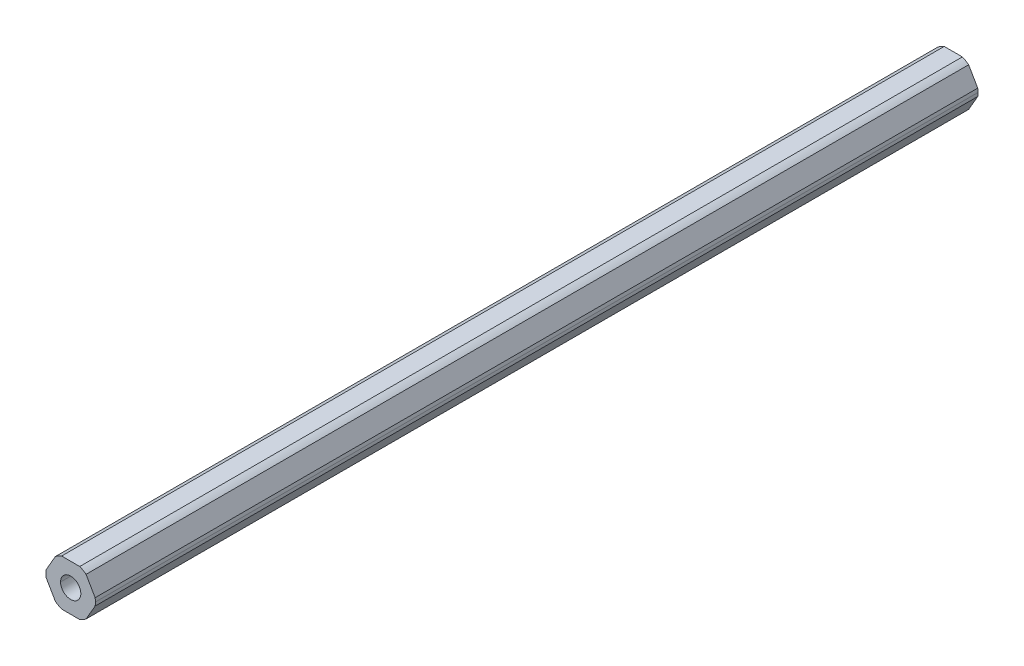
ISO-10303-21;
HEADER;
FILE_DESCRIPTION(('STEP AP214'),'2;1');
FILE_NAME('part.step','',(''),(''),'','','');
FILE_SCHEMA(('AUTOMOTIVE_DESIGN { 1 0 10303 214 1 1 1 1 }'));
ENDSEC;
DATA;
#1=APPLICATION_CONTEXT('core data for automotive mechanical design processes');
#2=APPLICATION_PROTOCOL_DEFINITION('international standard','automotive_design',2000,#1);
#3=PRODUCT_CONTEXT('',#1,'mechanical');
#4=PRODUCT('Part','Part','',(#3));
#5=PRODUCT_RELATED_PRODUCT_CATEGORY('part','',(#4));
#6=PRODUCT_DEFINITION_FORMATION('','',#4);
#7=PRODUCT_DEFINITION_CONTEXT('part definition',#1,'design');
#8=PRODUCT_DEFINITION('design','',#6,#7);
#9=PRODUCT_DEFINITION_SHAPE('','',#8);
#10=(LENGTH_UNIT() NAMED_UNIT(*) SI_UNIT(.MILLI.,.METRE.));
#11=(NAMED_UNIT(*) PLANE_ANGLE_UNIT() SI_UNIT($,.RADIAN.));
#12=(NAMED_UNIT(*) SI_UNIT($,.STERADIAN.) SOLID_ANGLE_UNIT());
#13=UNCERTAINTY_MEASURE_WITH_UNIT(LENGTH_MEASURE(1.E-05),#10,'distance_accuracy_value','');
#14=(GEOMETRIC_REPRESENTATION_CONTEXT(3) GLOBAL_UNCERTAINTY_ASSIGNED_CONTEXT((#13)) GLOBAL_UNIT_ASSIGNED_CONTEXT((#10,
#11,#12)) REPRESENTATION_CONTEXT('',''));
#15=CARTESIAN_POINT('',(0.,0.,0.));
#16=DIRECTION('',(0.,0.,1.));
#17=DIRECTION('',(1.,0.,0.));
#18=AXIS2_PLACEMENT_3D('',#15,#16,#17);
#19=CARTESIAN_POINT('',(0.,0.,-457.2));
#20=DIRECTION('',(0.,0.,1.));
#21=DIRECTION('',(1.,0.,0.));
#22=AXIS2_PLACEMENT_3D('',#19,#20,#21);
#23=CYLINDRICAL_SURFACE('',#22,2.1);
#24=CARTESIAN_POINT('',(0.,0.,-274.32));
#25=DIRECTION('',(0.,0.,1.));
#26=DIRECTION('',(1.,0.,0.));
#27=AXIS2_PLACEMENT_3D('',#24,#25,#26);
#28=CIRCLE('',#27,2.1);
#29=CARTESIAN_POINT('',(2.1,0.,-274.32));
#30=VERTEX_POINT('',#29);
#31=CARTESIAN_POINT('',(-2.1,0.,-274.32));
#32=VERTEX_POINT('',#31);
#33=EDGE_CURVE('E65',#30,#32,#28,.F.);
#34=ORIENTED_EDGE('',*,*,#33,.F.);
#35=DIRECTION('',(0.,0.,1.));
#36=VECTOR('',#35,1.);
#37=CARTESIAN_POINT('',(2.1,0.,-457.2));
#38=LINE('',#37,#36);
#39=CARTESIAN_POINT('',(2.1,0.,-457.2));
#40=VERTEX_POINT('',#39);
#41=EDGE_CURVE('E211',#40,#30,#38,.T.);
#42=ORIENTED_EDGE('',*,*,#41,.F.);
#43=CARTESIAN_POINT('',(0.,0.,-457.2));
#44=DIRECTION('',(0.,0.,1.));
#45=DIRECTION('',(1.,0.,0.));
#46=AXIS2_PLACEMENT_3D('',#43,#44,#45);
#47=CIRCLE('',#46,2.1);
#48=CARTESIAN_POINT('',(-2.1,0.,-457.2));
#49=VERTEX_POINT('',#48);
#50=EDGE_CURVE('E191',#49,#40,#47,.T.);
#51=ORIENTED_EDGE('',*,*,#50,.F.);
#52=DIRECTION('',(0.,0.,1.));
#53=VECTOR('',#52,1.);
#54=CARTESIAN_POINT('',(-2.1,0.,-457.2));
#55=LINE('',#54,#53);
#56=EDGE_CURVE('E52',#49,#32,#55,.T.);
#57=ORIENTED_EDGE('',*,*,#56,.T.);
#58=EDGE_LOOP('',(#34,#42,#51,#57));
#59=FACE_BOUND('',#58,.T.);
#60=ADVANCED_FACE('F44',(#59),#23,.F.);
#61=CARTESIAN_POINT('',(0.,0.,-457.2));
#62=DIRECTION('',(0.,0.,1.));
#63=DIRECTION('',(1.,0.,0.));
#64=AXIS2_PLACEMENT_3D('',#61,#62,#63);
#65=CYLINDRICAL_SURFACE('',#64,5.12);
#66=DIRECTION('',(0.,0.,1.));
#67=VECTOR('',#66,1.);
#68=CARTESIAN_POINT('',(5.12,0.,-457.2));
#69=LINE('',#68,#67);
#70=CARTESIAN_POINT('',(5.12,0.,-457.2));
#71=VERTEX_POINT('',#70);
#72=CARTESIAN_POINT('',(5.12,0.,-274.32));
#73=VERTEX_POINT('',#72);
#74=EDGE_CURVE('E227',#71,#73,#69,.T.);
#75=ORIENTED_EDGE('',*,*,#74,.T.);
#76=CARTESIAN_POINT('',(0.,0.,-274.32));
#77=DIRECTION('',(0.,0.,1.));
#78=DIRECTION('',(1.,0.,0.));
#79=AXIS2_PLACEMENT_3D('',#76,#77,#78);
#80=CIRCLE('',#79,5.12);
#81=CARTESIAN_POINT('',(5.06425896558911,-0.753446168913433,-274.32));
#82=VERTEX_POINT('',#81);
#83=EDGE_CURVE('E166',#82,#73,#80,.T.);
#84=ORIENTED_EDGE('',*,*,#83,.F.);
#85=DIRECTION('',(0.,0.,-1.));
#86=VECTOR('',#85,1.);
#87=CARTESIAN_POINT('',(5.06425896558911,-0.753446168913433,-457.2));
#88=LINE('',#87,#86);
#89=CARTESIAN_POINT('',(5.06425896558911,-0.753446168913433,-457.2));
#90=VERTEX_POINT('',#89);
#91=EDGE_CURVE('E230',#82,#90,#88,.T.);
#92=ORIENTED_EDGE('',*,*,#91,.T.);
#93=CARTESIAN_POINT('',(0.,0.,-457.2));
#94=DIRECTION('',(0.,0.,1.));
#95=DIRECTION('',(1.,0.,0.));
#96=AXIS2_PLACEMENT_3D('',#93,#94,#95);
#97=CIRCLE('',#96,5.12);
#98=EDGE_CURVE('E229',#90,#71,#97,.T.);
#99=ORIENTED_EDGE('',*,*,#98,.T.);
#100=EDGE_LOOP('',(#75,#84,#92,#99));
#101=FACE_BOUND('',#100,.T.);
#102=ADVANCED_FACE('F354',(#101),#65,.T.);
#103=CARTESIAN_POINT('',(2.74963065701564,-4.7625,457.2));
#104=DIRECTION('',(-0.866025403784442,0.5,0.));
#105=DIRECTION('',(0.,0.,1.));
#106=AXIS2_PLACEMENT_3D('',#103,#104,#105);
#107=PLANE('',#106);
#108=DIRECTION('',(0.499999999999991,0.866025403784444,0.));
#109=VECTOR('',#108,1.);
#110=CARTESIAN_POINT('',(3.18463300545771,-4.00905383108654,-274.32));
#111=LINE('',#110,#109);
#112=CARTESIAN_POINT('',(3.18463300545771,-4.00905383108654,-274.32));
#113=VERTEX_POINT('',#112);
#114=EDGE_CURVE('E313',#113,#82,#111,.T.);
#115=ORIENTED_EDGE('',*,*,#114,.F.);
#116=DIRECTION('',(0.,0.,1.));
#117=VECTOR('',#116,1.);
#118=CARTESIAN_POINT('',(3.1846330054577,-4.00905383108652,-457.2));
#119=LINE('',#118,#117);
#120=CARTESIAN_POINT('',(3.1846330054577,-4.00905383108652,-457.2));
#121=VERTEX_POINT('',#120);
#122=EDGE_CURVE('E185',#121,#113,#119,.T.);
#123=ORIENTED_EDGE('',*,*,#122,.F.);
#124=DIRECTION('',(0.5,0.866025403784442,0.));
#125=VECTOR('',#124,1.);
#126=CARTESIAN_POINT('',(2.74963065701564,-4.7625,-457.2));
#127=LINE('',#126,#125);
#128=EDGE_CURVE('E240',#121,#90,#127,.T.);
#129=ORIENTED_EDGE('',*,*,#128,.T.);
#130=ORIENTED_EDGE('',*,*,#91,.F.);
#131=EDGE_LOOP('',(#115,#123,#129,#130));
#132=FACE_BOUND('',#131,.T.);
#133=ADVANCED_FACE('F351',(#132),#107,.F.);
#134=CARTESIAN_POINT('',(5.49926131403117,0.,457.2));
#135=DIRECTION('',(-0.866025403784438,-0.5,0.));
#136=DIRECTION('',(-0.5,0.866025403784438,0.));
#137=AXIS2_PLACEMENT_3D('',#134,#135,#136);
#138=PLANE('',#137);
#139=DIRECTION('',(-0.500000000000001,0.866025403784438,0.));
#140=VECTOR('',#139,1.);
#141=CARTESIAN_POINT('',(5.06425896558911,0.753446168913416,-274.32));
#142=LINE('',#141,#140);
#143=CARTESIAN_POINT('',(5.06425896558911,0.753446168913416,-274.32));
#144=VERTEX_POINT('',#143);
#145=CARTESIAN_POINT('',(3.18463300545762,4.00905383108658,-274.32));
#146=VERTEX_POINT('',#145);
#147=EDGE_CURVE('E59',#144,#146,#142,.T.);
#148=ORIENTED_EDGE('',*,*,#147,.F.);
#149=DIRECTION('',(0.,0.,1.));
#150=VECTOR('',#149,1.);
#151=CARTESIAN_POINT('',(5.06425896558911,0.753446168913412,-457.2));
#152=LINE('',#151,#150);
#153=CARTESIAN_POINT('',(5.06425896558911,0.753446168913416,-457.2));
#154=VERTEX_POINT('',#153);
#155=EDGE_CURVE('E175',#154,#144,#152,.T.);
#156=ORIENTED_EDGE('',*,*,#155,.F.);
#157=DIRECTION('',(-0.5,0.866025403784438,0.));
#158=VECTOR('',#157,1.);
#159=CARTESIAN_POINT('',(5.49926131403117,0.,-457.2));
#160=LINE('',#159,#158);
#161=CARTESIAN_POINT('',(3.18463300545762,4.00905383108658,-457.2));
#162=VERTEX_POINT('',#161);
#163=EDGE_CURVE('E221',#154,#162,#160,.T.);
#164=ORIENTED_EDGE('',*,*,#163,.T.);
#165=DIRECTION('',(0.,0.,-1.));
#166=VECTOR('',#165,1.);
#167=CARTESIAN_POINT('',(3.18463300545762,4.00905383108658,-457.2));
#168=LINE('',#167,#166);
#169=EDGE_CURVE('E177',#146,#162,#168,.T.);
#170=ORIENTED_EDGE('',*,*,#169,.F.);
#171=EDGE_LOOP('',(#148,#156,#164,#170));
#172=FACE_BOUND('',#171,.T.);
#173=ADVANCED_FACE('F173',(#172),#138,.F.);
#174=CARTESIAN_POINT('',(2.74963065701557,4.7625,457.2));
#175=DIRECTION('',(0.,-1.,0.));
#176=DIRECTION('',(0.,0.,-1.));
#177=AXIS2_PLACEMENT_3D('',#174,#175,#176);
#178=PLANE('',#177);
#179=DIRECTION('',(-1.,0.,0.));
#180=VECTOR('',#179,1.);
#181=CARTESIAN_POINT('',(1.87962596013146,4.76249999999999,-274.32));
#182=LINE('',#181,#180);
#183=CARTESIAN_POINT('',(1.87962596013146,4.76249999999999,-274.32));
#184=VERTEX_POINT('',#183);
#185=CARTESIAN_POINT('',(-1.8796259601315,4.7625,-274.32));
#186=VERTEX_POINT('',#185);
#187=EDGE_CURVE('E328',#184,#186,#182,.T.);
#188=ORIENTED_EDGE('',*,*,#187,.F.);
#189=DIRECTION('',(0.,0.,1.));
#190=VECTOR('',#189,1.);
#191=CARTESIAN_POINT('',(1.87962596013147,4.7625,-457.2));
#192=LINE('',#191,#190);
#193=CARTESIAN_POINT('',(1.87962596013147,4.7625,-457.2));
#194=VERTEX_POINT('',#193);
#195=EDGE_CURVE('E202',#194,#184,#192,.T.);
#196=ORIENTED_EDGE('',*,*,#195,.F.);
#197=DIRECTION('',(-1.,0.,0.));
#198=VECTOR('',#197,1.);
#199=CARTESIAN_POINT('',(2.74963065701557,4.7625,-457.2));
#200=LINE('',#199,#198);
#201=CARTESIAN_POINT('',(-1.8796259601315,4.7625,-457.2));
#202=VERTEX_POINT('',#201);
#203=EDGE_CURVE('E255',#194,#202,#200,.T.);
#204=ORIENTED_EDGE('',*,*,#203,.T.);
#205=DIRECTION('',(0.,0.,-1.));
#206=VECTOR('',#205,1.);
#207=CARTESIAN_POINT('',(-1.8796259601315,4.7625,-457.2));
#208=LINE('',#207,#206);
#209=EDGE_CURVE('E249',#186,#202,#208,.T.);
#210=ORIENTED_EDGE('',*,*,#209,.F.);
#211=EDGE_LOOP('',(#188,#196,#204,#210));
#212=FACE_BOUND('',#211,.T.);
#213=ADVANCED_FACE('F334',(#212),#178,.F.);
#214=CARTESIAN_POINT('',(-2.7496306570156,4.7625,457.2));
#215=DIRECTION('',(0.866025403784442,-0.5,0.));
#216=DIRECTION('',(0.,0.,-1.));
#217=AXIS2_PLACEMENT_3D('',#214,#215,#216);
#218=PLANE('',#217);
#219=DIRECTION('',(-0.499999999999993,-0.866025403784443,0.));
#220=VECTOR('',#219,1.);
#221=CARTESIAN_POINT('',(-3.18463300545766,4.00905383108656,-274.32));
#222=LINE('',#221,#220);
#223=CARTESIAN_POINT('',(-3.18463300545767,4.00905383108657,-274.32));
#224=VERTEX_POINT('',#223);
#225=CARTESIAN_POINT('',(-5.06425896558912,0.753446168913382,-274.32));
#226=VERTEX_POINT('',#225);
#227=EDGE_CURVE('E324',#224,#226,#222,.T.);
#228=ORIENTED_EDGE('',*,*,#227,.F.);
#229=DIRECTION('',(0.,0.,1.));
#230=VECTOR('',#229,1.);
#231=CARTESIAN_POINT('',(-3.18463300545766,4.00905383108655,-457.2));
#232=LINE('',#231,#230);
#233=CARTESIAN_POINT('',(-3.18463300545766,4.00905383108655,-457.2));
#234=VERTEX_POINT('',#233);
#235=EDGE_CURVE('E208',#234,#224,#232,.T.);
#236=ORIENTED_EDGE('',*,*,#235,.F.);
#237=DIRECTION('',(-0.5,-0.866025403784442,0.));
#238=VECTOR('',#237,1.);
#239=CARTESIAN_POINT('',(-2.7496306570156,4.7625,-457.2));
#240=LINE('',#239,#238);
#241=CARTESIAN_POINT('',(-5.06425896558912,0.753446168913382,-457.2));
#242=VERTEX_POINT('',#241);
#243=EDGE_CURVE('E252',#234,#242,#240,.T.);
#244=ORIENTED_EDGE('',*,*,#243,.T.);
#245=DIRECTION('',(0.,0.,-1.));
#246=VECTOR('',#245,1.);
#247=CARTESIAN_POINT('',(-5.06425896558912,0.753446168913382,-457.2));
#248=LINE('',#247,#246);
#249=EDGE_CURVE('E239',#226,#242,#248,.T.);
#250=ORIENTED_EDGE('',*,*,#249,.F.);
#251=EDGE_LOOP('',(#228,#236,#244,#250));
#252=FACE_BOUND('',#251,.T.);
#253=ADVANCED_FACE('F267',(#252),#218,.F.);
#254=CARTESIAN_POINT('',(-5.49926131403117,0.,457.2));
#255=DIRECTION('',(0.866025403784435,0.500000000000007,0.));
#256=DIRECTION('',(0.,0.,-1.));
#257=AXIS2_PLACEMENT_3D('',#254,#255,#256);
#258=PLANE('',#257);
#259=DIRECTION('',(0.500000000000007,-0.866025403784435,0.));
#260=VECTOR('',#259,1.);
#261=CARTESIAN_POINT('',(-5.06425896558911,-0.753446168913448,-274.32));
#262=LINE('',#261,#260);
#263=CARTESIAN_POINT('',(-5.06425896558911,-0.753446168913446,-274.32));
#264=VERTEX_POINT('',#263);
#265=CARTESIAN_POINT('',(-3.1846330054576,-4.0090538310866,-274.32));
#266=VERTEX_POINT('',#265);
#267=EDGE_CURVE('E321',#264,#266,#262,.T.);
#268=ORIENTED_EDGE('',*,*,#267,.F.);
#269=DIRECTION('',(0.,0.,1.));
#270=VECTOR('',#269,1.);
#271=CARTESIAN_POINT('',(-5.06425896558911,-0.75344616891345,-457.2));
#272=LINE('',#271,#270);
#273=CARTESIAN_POINT('',(-5.06425896558911,-0.75344616891345,-457.2));
#274=VERTEX_POINT('',#273);
#275=EDGE_CURVE('E247',#274,#264,#272,.T.);
#276=ORIENTED_EDGE('',*,*,#275,.F.);
#277=DIRECTION('',(0.500000000000007,-0.866025403784435,0.));
#278=VECTOR('',#277,1.);
#279=CARTESIAN_POINT('',(-5.49926131403117,0.,-457.2));
#280=LINE('',#279,#278);
#281=CARTESIAN_POINT('',(-3.1846330054576,-4.0090538310866,-457.2));
#282=VERTEX_POINT('',#281);
#283=EDGE_CURVE('E256',#274,#282,#280,.T.);
#284=ORIENTED_EDGE('',*,*,#283,.T.);
#285=DIRECTION('',(0.,0.,-1.));
#286=VECTOR('',#285,1.);
#287=CARTESIAN_POINT('',(-3.1846330054576,-4.0090538310866,-457.2));
#288=LINE('',#287,#286);
#289=EDGE_CURVE('E223',#266,#282,#288,.T.);
#290=ORIENTED_EDGE('',*,*,#289,.F.);
#291=EDGE_LOOP('',(#268,#276,#284,#290));
#292=FACE_BOUND('',#291,.T.);
#293=ADVANCED_FACE('F340',(#292),#258,.F.);
#294=CARTESIAN_POINT('',(-2.74963065701554,-4.7625,457.2));
#295=DIRECTION('',(0.,1.,0.));
#296=DIRECTION('',(1.,0.,0.));
#297=AXIS2_PLACEMENT_3D('',#294,#295,#296);
#298=PLANE('',#297);
#299=DIRECTION('',(1.,0.,0.));
#300=VECTOR('',#299,1.);
#301=CARTESIAN_POINT('',(-1.87962596013144,-4.7625,-274.32));
#302=LINE('',#301,#300);
#303=CARTESIAN_POINT('',(-1.87962596013144,-4.7625,-274.32));
#304=VERTEX_POINT('',#303);
#305=CARTESIAN_POINT('',(1.87962596013154,-4.7625,-274.32));
#306=VERTEX_POINT('',#305);
#307=EDGE_CURVE('E317',#304,#306,#302,.T.);
#308=ORIENTED_EDGE('',*,*,#307,.F.);
#309=DIRECTION('',(0.,0.,1.));
#310=VECTOR('',#309,1.);
#311=CARTESIAN_POINT('',(-1.87962596013144,-4.7625,-457.2));
#312=LINE('',#311,#310);
#313=CARTESIAN_POINT('',(-1.87962596013144,-4.7625,-457.2));
#314=VERTEX_POINT('',#313);
#315=EDGE_CURVE('E235',#314,#304,#312,.T.);
#316=ORIENTED_EDGE('',*,*,#315,.F.);
#317=DIRECTION('',(1.,0.,0.));
#318=VECTOR('',#317,1.);
#319=CARTESIAN_POINT('',(-2.74963065701554,-4.7625,-457.2));
#320=LINE('',#319,#318);
#321=CARTESIAN_POINT('',(1.87962596013154,-4.7625,-457.2));
#322=VERTEX_POINT('',#321);
#323=EDGE_CURVE('E280',#314,#322,#320,.T.);
#324=ORIENTED_EDGE('',*,*,#323,.T.);
#325=DIRECTION('',(0.,0.,-1.));
#326=VECTOR('',#325,1.);
#327=CARTESIAN_POINT('',(1.87962596013154,-4.7625,-457.2));
#328=LINE('',#327,#326);
#329=EDGE_CURVE('E195',#306,#322,#328,.T.);
#330=ORIENTED_EDGE('',*,*,#329,.F.);
#331=EDGE_LOOP('',(#308,#316,#324,#330));
#332=FACE_BOUND('',#331,.T.);
#333=ADVANCED_FACE('F345',(#332),#298,.F.);
#334=CARTESIAN_POINT('',(0.,0.,-457.2));
#335=DIRECTION('',(0.,0.,1.));
#336=DIRECTION('',(1.,0.,0.));
#337=AXIS2_PLACEMENT_3D('',#334,#335,#336);
#338=CYLINDRICAL_SURFACE('',#337,5.12);
#339=ORIENTED_EDGE('',*,*,#155,.T.);
#340=EDGE_CURVE('E163',#73,#144,#80,.T.);
#341=ORIENTED_EDGE('',*,*,#340,.F.);
#342=ORIENTED_EDGE('',*,*,#74,.F.);
#343=CARTESIAN_POINT('',(0.,0.,-457.2));
#344=DIRECTION('',(0.,0.,1.));
#345=DIRECTION('',(1.,0.,0.));
#346=AXIS2_PLACEMENT_3D('',#343,#344,#345);
#347=CIRCLE('',#346,5.12);
#348=EDGE_CURVE('E183',#71,#154,#347,.T.);
#349=ORIENTED_EDGE('',*,*,#348,.T.);
#350=EDGE_LOOP('',(#339,#341,#342,#349));
#351=FACE_BOUND('',#350,.T.);
#352=ADVANCED_FACE('F181',(#351),#338,.T.);
#353=CARTESIAN_POINT('',(0.,0.,-457.2));
#354=DIRECTION('',(0.,0.,1.));
#355=DIRECTION('',(1.,0.,0.));
#356=AXIS2_PLACEMENT_3D('',#353,#354,#355);
#357=CYLINDRICAL_SURFACE('',#356,5.12);
#358=ORIENTED_EDGE('',*,*,#122,.T.);
#359=CARTESIAN_POINT('',(0.,0.,-274.32));
#360=DIRECTION('',(0.,0.,1.));
#361=DIRECTION('',(1.,0.,0.));
#362=AXIS2_PLACEMENT_3D('',#359,#360,#361);
#363=CIRCLE('',#362,5.12000000000003);
#364=EDGE_CURVE('E315',#306,#113,#363,.T.);
#365=ORIENTED_EDGE('',*,*,#364,.F.);
#366=ORIENTED_EDGE('',*,*,#329,.T.);
#367=CARTESIAN_POINT('',(0.,0.,-457.2));
#368=DIRECTION('',(0.,0.,1.));
#369=DIRECTION('',(1.,0.,0.));
#370=AXIS2_PLACEMENT_3D('',#367,#368,#369);
#371=CIRCLE('',#370,5.12);
#372=EDGE_CURVE('E225',#322,#121,#371,.T.);
#373=ORIENTED_EDGE('',*,*,#372,.T.);
#374=EDGE_LOOP('',(#358,#365,#366,#373));
#375=FACE_BOUND('',#374,.T.);
#376=ADVANCED_FACE('F352',(#375),#357,.T.);
#377=CARTESIAN_POINT('',(0.,0.,-457.2));
#378=DIRECTION('',(0.,0.,1.));
#379=DIRECTION('',(1.,0.,0.));
#380=AXIS2_PLACEMENT_3D('',#377,#378,#379);
#381=CYLINDRICAL_SURFACE('',#380,5.12);
#382=ORIENTED_EDGE('',*,*,#315,.T.);
#383=CARTESIAN_POINT('',(0.,0.,-274.32));
#384=DIRECTION('',(0.,0.,1.));
#385=DIRECTION('',(1.,0.,0.));
#386=AXIS2_PLACEMENT_3D('',#383,#384,#385);
#387=CIRCLE('',#386,5.12);
#388=EDGE_CURVE('E319',#266,#304,#387,.T.);
#389=ORIENTED_EDGE('',*,*,#388,.F.);
#390=ORIENTED_EDGE('',*,*,#289,.T.);
#391=CARTESIAN_POINT('',(0.,0.,-457.2));
#392=DIRECTION('',(0.,0.,1.));
#393=DIRECTION('',(1.,0.,0.));
#394=AXIS2_PLACEMENT_3D('',#391,#392,#393);
#395=CIRCLE('',#394,5.12);
#396=EDGE_CURVE('E226',#282,#314,#395,.T.);
#397=ORIENTED_EDGE('',*,*,#396,.T.);
#398=EDGE_LOOP('',(#382,#389,#390,#397));
#399=FACE_BOUND('',#398,.T.);
#400=ADVANCED_FACE('F342',(#399),#381,.T.);
#401=CARTESIAN_POINT('',(0.,0.,-457.2));
#402=DIRECTION('',(0.,0.,1.));
#403=DIRECTION('',(1.,0.,0.));
#404=AXIS2_PLACEMENT_3D('',#401,#402,#403);
#405=CYLINDRICAL_SURFACE('',#404,5.12);
#406=ORIENTED_EDGE('',*,*,#275,.T.);
#407=CARTESIAN_POINT('',(0.,0.,-274.32));
#408=DIRECTION('',(0.,0.,1.));
#409=DIRECTION('',(1.,0.,0.));
#410=AXIS2_PLACEMENT_3D('',#407,#408,#409);
#411=CIRCLE('',#410,5.12);
#412=EDGE_CURVE('E263',#226,#264,#411,.T.);
#413=ORIENTED_EDGE('',*,*,#412,.F.);
#414=ORIENTED_EDGE('',*,*,#249,.T.);
#415=CARTESIAN_POINT('',(0.,0.,-457.2));
#416=DIRECTION('',(0.,0.,1.));
#417=DIRECTION('',(1.,0.,0.));
#418=AXIS2_PLACEMENT_3D('',#415,#416,#417);
#419=CIRCLE('',#418,5.12);
#420=EDGE_CURVE('E244',#242,#274,#419,.T.);
#421=ORIENTED_EDGE('',*,*,#420,.T.);
#422=EDGE_LOOP('',(#406,#413,#414,#421));
#423=FACE_BOUND('',#422,.T.);
#424=ADVANCED_FACE('F261',(#423),#405,.T.);
#425=CARTESIAN_POINT('',(0.,0.,-457.2));
#426=DIRECTION('',(0.,0.,1.));
#427=DIRECTION('',(1.,0.,0.));
#428=AXIS2_PLACEMENT_3D('',#425,#426,#427);
#429=CYLINDRICAL_SURFACE('',#428,5.12);
#430=ORIENTED_EDGE('',*,*,#235,.T.);
#431=CARTESIAN_POINT('',(0.,0.,-274.32));
#432=DIRECTION('',(0.,0.,1.));
#433=DIRECTION('',(1.,0.,0.));
#434=AXIS2_PLACEMENT_3D('',#431,#432,#433);
#435=CIRCLE('',#434,5.12000000000002);
#436=EDGE_CURVE('E326',#186,#224,#435,.T.);
#437=ORIENTED_EDGE('',*,*,#436,.F.);
#438=ORIENTED_EDGE('',*,*,#209,.T.);
#439=CARTESIAN_POINT('',(0.,0.,-457.2));
#440=DIRECTION('',(0.,0.,1.));
#441=DIRECTION('',(1.,0.,0.));
#442=AXIS2_PLACEMENT_3D('',#439,#440,#441);
#443=CIRCLE('',#442,5.12);
#444=EDGE_CURVE('E234',#202,#234,#443,.T.);
#445=ORIENTED_EDGE('',*,*,#444,.T.);
#446=EDGE_LOOP('',(#430,#437,#438,#445));
#447=FACE_BOUND('',#446,.T.);
#448=ADVANCED_FACE('F337',(#447),#429,.T.);
#449=CARTESIAN_POINT('',(0.,0.,-457.2));
#450=DIRECTION('',(0.,0.,1.));
#451=DIRECTION('',(1.,0.,0.));
#452=AXIS2_PLACEMENT_3D('',#449,#450,#451);
#453=CYLINDRICAL_SURFACE('',#452,5.12);
#454=ORIENTED_EDGE('',*,*,#195,.T.);
#455=CARTESIAN_POINT('',(0.,0.,-274.32));
#456=DIRECTION('',(0.,0.,1.));
#457=DIRECTION('',(1.,0.,0.));
#458=AXIS2_PLACEMENT_3D('',#455,#456,#457);
#459=CIRCLE('',#458,5.12);
#460=EDGE_CURVE('E178',#146,#184,#459,.T.);
#461=ORIENTED_EDGE('',*,*,#460,.F.);
#462=ORIENTED_EDGE('',*,*,#169,.T.);
#463=CARTESIAN_POINT('',(0.,0.,-457.2));
#464=DIRECTION('',(0.,0.,1.));
#465=DIRECTION('',(1.,0.,0.));
#466=AXIS2_PLACEMENT_3D('',#463,#464,#465);
#467=CIRCLE('',#466,5.12);
#468=EDGE_CURVE('E200',#162,#194,#467,.T.);
#469=ORIENTED_EDGE('',*,*,#468,.T.);
#470=EDGE_LOOP('',(#454,#461,#462,#469));
#471=FACE_BOUND('',#470,.T.);
#472=ADVANCED_FACE('F369',(#471),#453,.T.);
#473=CARTESIAN_POINT('',(0.,0.,-457.2));
#474=DIRECTION('',(0.,0.,1.));
#475=DIRECTION('',(1.,0.,0.));
#476=AXIS2_PLACEMENT_3D('',#473,#474,#475);
#477=CYLINDRICAL_SURFACE('',#476,2.1);
#478=CARTESIAN_POINT('',(0.,0.,-274.32));
#479=DIRECTION('',(0.,0.,1.));
#480=DIRECTION('',(1.,0.,0.));
#481=AXIS2_PLACEMENT_3D('',#478,#479,#480);
#482=CIRCLE('',#481,2.1);
#483=EDGE_CURVE('E11',#32,#30,#482,.F.);
#484=ORIENTED_EDGE('',*,*,#483,.F.);
#485=ORIENTED_EDGE('',*,*,#56,.F.);
#486=CARTESIAN_POINT('',(0.,0.,-457.2));
#487=DIRECTION('',(0.,0.,1.));
#488=DIRECTION('',(1.,0.,0.));
#489=AXIS2_PLACEMENT_3D('',#486,#487,#488);
#490=CIRCLE('',#489,2.1);
#491=EDGE_CURVE('E198',#40,#49,#490,.T.);
#492=ORIENTED_EDGE('',*,*,#491,.F.);
#493=ORIENTED_EDGE('',*,*,#41,.T.);
#494=EDGE_LOOP('',(#484,#485,#492,#493));
#495=FACE_BOUND('',#494,.T.);
#496=ADVANCED_FACE('F385',(#495),#477,.F.);
#497=CARTESIAN_POINT('',(0.,0.,-457.2));
#498=DIRECTION('',(0.,0.,1.));
#499=DIRECTION('',(1.,0.,0.));
#500=AXIS2_PLACEMENT_3D('',#497,#498,#499);
#501=PLANE('',#500);
#502=ORIENTED_EDGE('',*,*,#468,.F.);
#503=ORIENTED_EDGE('',*,*,#163,.F.);
#504=ORIENTED_EDGE('',*,*,#348,.F.);
#505=ORIENTED_EDGE('',*,*,#98,.F.);
#506=ORIENTED_EDGE('',*,*,#128,.F.);
#507=ORIENTED_EDGE('',*,*,#372,.F.);
#508=ORIENTED_EDGE('',*,*,#323,.F.);
#509=ORIENTED_EDGE('',*,*,#396,.F.);
#510=ORIENTED_EDGE('',*,*,#283,.F.);
#511=ORIENTED_EDGE('',*,*,#420,.F.);
#512=ORIENTED_EDGE('',*,*,#243,.F.);
#513=ORIENTED_EDGE('',*,*,#444,.F.);
#514=ORIENTED_EDGE('',*,*,#203,.F.);
#515=EDGE_LOOP('',(#502,#503,#504,#505,#506,#507,#508,#509,#510,#511,#512,#513,#514));
#516=FACE_BOUND('',#515,.T.);
#517=ORIENTED_EDGE('',*,*,#491,.T.);
#518=ORIENTED_EDGE('',*,*,#50,.T.);
#519=EDGE_LOOP('',(#517,#518));
#520=FACE_BOUND('',#519,.T.);
#521=ADVANCED_FACE('F46',(#516,#520),#501,.F.);
#522=CARTESIAN_POINT('',(0.,0.,-274.32));
#523=DIRECTION('',(0.,0.,1.));
#524=DIRECTION('',(1.,0.,0.));
#525=AXIS2_PLACEMENT_3D('',#522,#523,#524);
#526=PLANE('',#525);
#527=ORIENTED_EDGE('',*,*,#83,.T.);
#528=ORIENTED_EDGE('',*,*,#340,.T.);
#529=ORIENTED_EDGE('',*,*,#147,.T.);
#530=ORIENTED_EDGE('',*,*,#460,.T.);
#531=ORIENTED_EDGE('',*,*,#187,.T.);
#532=ORIENTED_EDGE('',*,*,#436,.T.);
#533=ORIENTED_EDGE('',*,*,#227,.T.);
#534=ORIENTED_EDGE('',*,*,#412,.T.);
#535=ORIENTED_EDGE('',*,*,#267,.T.);
#536=ORIENTED_EDGE('',*,*,#388,.T.);
#537=ORIENTED_EDGE('',*,*,#307,.T.);
#538=ORIENTED_EDGE('',*,*,#364,.T.);
#539=ORIENTED_EDGE('',*,*,#114,.T.);
#540=EDGE_LOOP('',(#527,#528,#529,#530,#531,#532,#533,#534,#535,#536,#537,#538,#539));
#541=FACE_BOUND('',#540,.T.);
#542=ORIENTED_EDGE('',*,*,#33,.T.);
#543=ORIENTED_EDGE('',*,*,#483,.T.);
#544=EDGE_LOOP('',(#542,#543));
#545=FACE_BOUND('',#544,.T.);
#546=ADVANCED_FACE('F164',(#541,#545),#526,.T.);
#547=CLOSED_SHELL('',(#60,#102,#133,#173,#213,#253,#293,#333,#352,#376,#400,#424,#448,#472,#496,
#521,#546));
#548=MANIFOLD_SOLID_BREP('B2',#547);
#549=ADVANCED_BREP_SHAPE_REPRESENTATION('',(#18,#548),#14);
#550=SHAPE_DEFINITION_REPRESENTATION(#9,#549);
ENDSEC;
END-ISO-10303-21;
